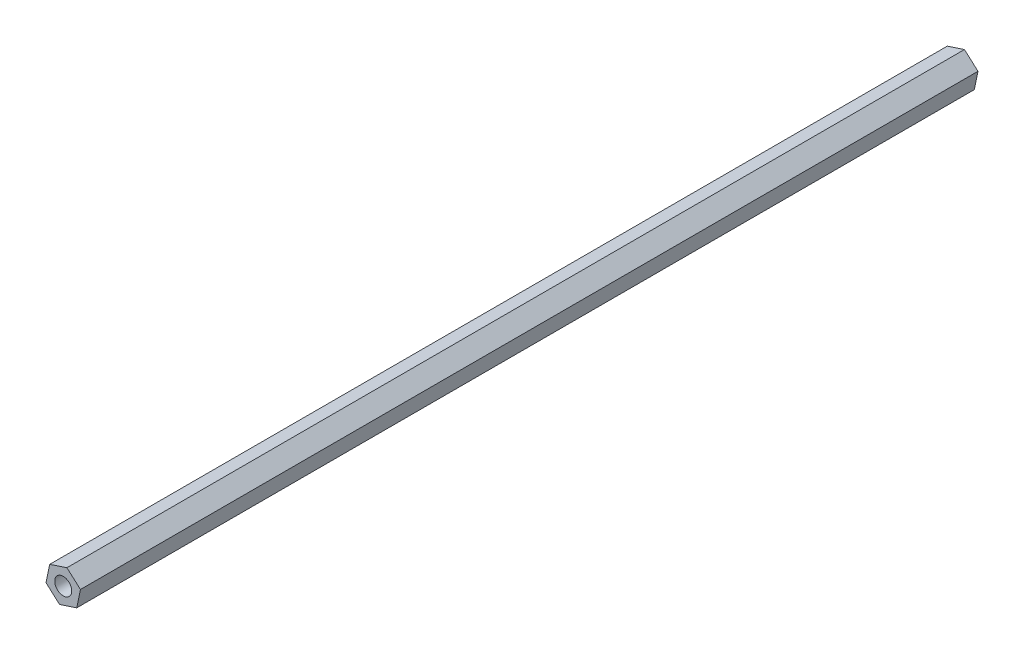
ISO-10303-21;
HEADER;
FILE_DESCRIPTION(('STEP AP214'),'2;1');
FILE_NAME('part.step','',(''),(''),'','','');
FILE_SCHEMA(('AUTOMOTIVE_DESIGN { 1 0 10303 214 1 1 1 1 }'));
ENDSEC;
DATA;
#1=APPLICATION_CONTEXT('core data for automotive mechanical design processes');
#2=APPLICATION_PROTOCOL_DEFINITION('international standard','automotive_design',2000,#1);
#3=PRODUCT_CONTEXT('',#1,'mechanical');
#4=PRODUCT('Part','Part','',(#3));
#5=PRODUCT_RELATED_PRODUCT_CATEGORY('part','',(#4));
#6=PRODUCT_DEFINITION_FORMATION('','',#4);
#7=PRODUCT_DEFINITION_CONTEXT('part definition',#1,'design');
#8=PRODUCT_DEFINITION('design','',#6,#7);
#9=PRODUCT_DEFINITION_SHAPE('','',#8);
#10=(LENGTH_UNIT() NAMED_UNIT(*) SI_UNIT(.MILLI.,.METRE.));
#11=(NAMED_UNIT(*) PLANE_ANGLE_UNIT() SI_UNIT($,.RADIAN.));
#12=(NAMED_UNIT(*) SI_UNIT($,.STERADIAN.) SOLID_ANGLE_UNIT());
#13=UNCERTAINTY_MEASURE_WITH_UNIT(LENGTH_MEASURE(1.E-05),#10,'distance_accuracy_value','');
#14=(GEOMETRIC_REPRESENTATION_CONTEXT(3) GLOBAL_UNCERTAINTY_ASSIGNED_CONTEXT((#13)) GLOBAL_UNIT_ASSIGNED_CONTEXT((#10,
#11,#12)) REPRESENTATION_CONTEXT('',''));
#15=CARTESIAN_POINT('',(0.,0.,0.));
#16=DIRECTION('',(0.,0.,1.));
#17=DIRECTION('',(1.,0.,0.));
#18=AXIS2_PLACEMENT_3D('',#15,#16,#17);
#19=CARTESIAN_POINT('',(2.71432127636962,-2.42125174417019,180.));
#20=DIRECTION('',(-0.979102767295746,0.203366101093109,0.));
#21=DIRECTION('',(-0.203366101093109,-0.979102767295746,0.));
#22=AXIS2_PLACEMENT_3D('',#19,#20,#21);
#23=PLANE('',#22);
#24=DIRECTION('',(0.203366101093109,0.979102767295746,0.));
#25=VECTOR('',#24,1.);
#26=CARTESIAN_POINT('',(2.71432127636962,-2.42125174417019,0.));
#27=LINE('',#26,#25);
#28=CARTESIAN_POINT('',(2.71432127636962,-2.42125174417019,0.));
#29=VERTEX_POINT('',#28);
#30=CARTESIAN_POINT('',(3.45402615759358,1.1400453072836,0.));
#31=VERTEX_POINT('',#30);
#32=EDGE_CURVE('E117',#29,#31,#27,.T.);
#33=ORIENTED_EDGE('',*,*,#32,.T.);
#34=DIRECTION('',(0.,0.,-1.));
#35=VECTOR('',#34,1.);
#36=CARTESIAN_POINT('',(3.45402615759358,1.1400453072836,180.));
#37=LINE('',#36,#35);
#38=CARTESIAN_POINT('',(3.45402615759358,1.1400453072836,180.));
#39=VERTEX_POINT('',#38);
#40=EDGE_CURVE('E11',#39,#31,#37,.T.);
#41=ORIENTED_EDGE('',*,*,#40,.F.);
#42=DIRECTION('',(0.203366101093109,0.979102767295746,0.));
#43=VECTOR('',#42,1.);
#44=CARTESIAN_POINT('',(2.71432127636962,-2.42125174417019,180.));
#45=LINE('',#44,#43);
#46=CARTESIAN_POINT('',(2.71432127636962,-2.42125174417019,180.));
#47=VERTEX_POINT('',#46);
#48=EDGE_CURVE('E128',#47,#39,#45,.T.);
#49=ORIENTED_EDGE('',*,*,#48,.F.);
#50=DIRECTION('',(0.,0.,-1.));
#51=VECTOR('',#50,1.);
#52=CARTESIAN_POINT('',(2.71432127636962,-2.42125174417019,180.));
#53=LINE('',#52,#51);
#54=EDGE_CURVE('E113',#47,#29,#53,.T.);
#55=ORIENTED_EDGE('',*,*,#54,.T.);
#56=EDGE_LOOP('',(#33,#41,#49,#55));
#57=FACE_BOUND('',#56,.T.);
#58=ADVANCED_FACE('F33',(#57),#23,.F.);
#59=CARTESIAN_POINT('',(3.45402615759358,1.1400453072836,180.));
#60=DIRECTION('',(-0.6656715934631,-0.746244818847205,0.));
#61=DIRECTION('',(0.746244818847205,-0.6656715934631,0.));
#62=AXIS2_PLACEMENT_3D('',#59,#60,#61);
#63=PLANE('',#62);
#64=DIRECTION('',(-0.746244818847205,0.6656715934631,0.));
#65=VECTOR('',#64,1.);
#66=CARTESIAN_POINT('',(3.45402615759358,1.1400453072836,0.));
#67=LINE('',#66,#65);
#68=CARTESIAN_POINT('',(0.739704881223952,3.56129705145379,0.));
#69=VERTEX_POINT('',#68);
#70=EDGE_CURVE('E120',#31,#69,#67,.T.);
#71=ORIENTED_EDGE('',*,*,#70,.T.);
#72=DIRECTION('',(0.,0.,-1.));
#73=VECTOR('',#72,1.);
#74=CARTESIAN_POINT('',(0.739704881223952,3.56129705145379,180.));
#75=LINE('',#74,#73);
#76=CARTESIAN_POINT('',(0.739704881223952,3.56129705145379,180.));
#77=VERTEX_POINT('',#76);
#78=EDGE_CURVE('E41',#77,#69,#75,.T.);
#79=ORIENTED_EDGE('',*,*,#78,.F.);
#80=DIRECTION('',(-0.746244818847205,0.6656715934631,0.));
#81=VECTOR('',#80,1.);
#82=CARTESIAN_POINT('',(3.45402615759358,1.1400453072836,180.));
#83=LINE('',#82,#81);
#84=EDGE_CURVE('E86',#39,#77,#83,.T.);
#85=ORIENTED_EDGE('',*,*,#84,.F.);
#86=ORIENTED_EDGE('',*,*,#40,.T.);
#87=EDGE_LOOP('',(#71,#79,#85,#86));
#88=FACE_BOUND('',#87,.T.);
#89=ADVANCED_FACE('F153',(#88),#63,.F.);
#90=CARTESIAN_POINT('',(0.739704881223952,3.56129705145379,180.));
#91=DIRECTION('',(0.313431173832646,-0.949610919940314,0.));
#92=DIRECTION('',(0.949610919940314,0.313431173832646,0.));
#93=AXIS2_PLACEMENT_3D('',#90,#91,#92);
#94=PLANE('',#93);
#95=DIRECTION('',(-0.949610919940314,-0.313431173832646,0.));
#96=VECTOR('',#95,1.);
#97=CARTESIAN_POINT('',(0.739704881223952,3.56129705145379,0.));
#98=LINE('',#97,#96);
#99=CARTESIAN_POINT('',(-2.71432127636962,2.42125174417019,0.));
#100=VERTEX_POINT('',#99);
#101=EDGE_CURVE('E123',#69,#100,#98,.T.);
#102=ORIENTED_EDGE('',*,*,#101,.T.);
#103=DIRECTION('',(0.,0.,-1.));
#104=VECTOR('',#103,1.);
#105=CARTESIAN_POINT('',(-2.71432127636962,2.42125174417019,180.));
#106=LINE('',#105,#104);
#107=CARTESIAN_POINT('',(-2.71432127636962,2.42125174417019,180.));
#108=VERTEX_POINT('',#107);
#109=EDGE_CURVE('E108',#108,#100,#106,.T.);
#110=ORIENTED_EDGE('',*,*,#109,.F.);
#111=DIRECTION('',(-0.949610919940314,-0.313431173832646,0.));
#112=VECTOR('',#111,1.);
#113=CARTESIAN_POINT('',(0.739704881223952,3.56129705145379,180.));
#114=LINE('',#113,#112);
#115=EDGE_CURVE('E99',#77,#108,#114,.T.);
#116=ORIENTED_EDGE('',*,*,#115,.F.);
#117=ORIENTED_EDGE('',*,*,#78,.T.);
#118=EDGE_LOOP('',(#102,#110,#116,#117));
#119=FACE_BOUND('',#118,.T.);
#120=ADVANCED_FACE('F134',(#119),#94,.F.);
#121=CARTESIAN_POINT('',(-2.71432127636962,2.42125174417019,180.));
#122=DIRECTION('',(0.979102767295746,-0.203366101093109,0.));
#123=DIRECTION('',(0.203366101093109,0.979102767295746,0.));
#124=AXIS2_PLACEMENT_3D('',#121,#122,#123);
#125=PLANE('',#124);
#126=DIRECTION('',(-0.203366101093109,-0.979102767295746,0.));
#127=VECTOR('',#126,1.);
#128=CARTESIAN_POINT('',(-2.71432127636962,2.42125174417019,0.));
#129=LINE('',#128,#127);
#130=CARTESIAN_POINT('',(-3.45402615759358,-1.1400453072836,0.));
#131=VERTEX_POINT('',#130);
#132=EDGE_CURVE('E107',#100,#131,#129,.T.);
#133=ORIENTED_EDGE('',*,*,#132,.T.);
#134=DIRECTION('',(0.,0.,-1.));
#135=VECTOR('',#134,1.);
#136=CARTESIAN_POINT('',(-3.45402615759358,-1.1400453072836,180.));
#137=LINE('',#136,#135);
#138=CARTESIAN_POINT('',(-3.45402615759358,-1.1400453072836,180.));
#139=VERTEX_POINT('',#138);
#140=EDGE_CURVE('E104',#139,#131,#137,.T.);
#141=ORIENTED_EDGE('',*,*,#140,.F.);
#142=DIRECTION('',(-0.203366101093109,-0.979102767295746,0.));
#143=VECTOR('',#142,1.);
#144=CARTESIAN_POINT('',(-2.71432127636962,2.42125174417019,180.));
#145=LINE('',#144,#143);
#146=EDGE_CURVE('E93',#108,#139,#145,.T.);
#147=ORIENTED_EDGE('',*,*,#146,.F.);
#148=ORIENTED_EDGE('',*,*,#109,.T.);
#149=EDGE_LOOP('',(#133,#141,#147,#148));
#150=FACE_BOUND('',#149,.T.);
#151=ADVANCED_FACE('F105',(#150),#125,.F.);
#152=CARTESIAN_POINT('',(-3.45402615759358,-1.1400453072836,180.));
#153=DIRECTION('',(0.6656715934631,0.746244818847205,0.));
#154=DIRECTION('',(-0.746244818847205,0.6656715934631,0.));
#155=AXIS2_PLACEMENT_3D('',#152,#153,#154);
#156=PLANE('',#155);
#157=DIRECTION('',(0.746244818847205,-0.6656715934631,0.));
#158=VECTOR('',#157,1.);
#159=CARTESIAN_POINT('',(-3.45402615759358,-1.1400453072836,0.));
#160=LINE('',#159,#158);
#161=CARTESIAN_POINT('',(-0.739704881223952,-3.56129705145379,0.));
#162=VERTEX_POINT('',#161);
#163=EDGE_CURVE('E72',#131,#162,#160,.T.);
#164=ORIENTED_EDGE('',*,*,#163,.T.);
#165=DIRECTION('',(0.,0.,-1.));
#166=VECTOR('',#165,1.);
#167=CARTESIAN_POINT('',(-0.739704881223952,-3.56129705145379,180.));
#168=LINE('',#167,#166);
#169=CARTESIAN_POINT('',(-0.739704881223952,-3.56129705145379,180.));
#170=VERTEX_POINT('',#169);
#171=EDGE_CURVE('E109',#170,#162,#168,.T.);
#172=ORIENTED_EDGE('',*,*,#171,.F.);
#173=DIRECTION('',(0.746244818847205,-0.6656715934631,0.));
#174=VECTOR('',#173,1.);
#175=CARTESIAN_POINT('',(-3.45402615759358,-1.1400453072836,180.));
#176=LINE('',#175,#174);
#177=EDGE_CURVE('E97',#139,#170,#176,.T.);
#178=ORIENTED_EDGE('',*,*,#177,.F.);
#179=ORIENTED_EDGE('',*,*,#140,.T.);
#180=EDGE_LOOP('',(#164,#172,#178,#179));
#181=FACE_BOUND('',#180,.T.);
#182=ADVANCED_FACE('F111',(#181),#156,.F.);
#183=CARTESIAN_POINT('',(-0.739704881223952,-3.56129705145379,180.));
#184=DIRECTION('',(-0.313431173832646,0.949610919940314,0.));
#185=DIRECTION('',(-0.949610919940314,-0.313431173832646,0.));
#186=AXIS2_PLACEMENT_3D('',#183,#184,#185);
#187=PLANE('',#186);
#188=DIRECTION('',(0.949610919940314,0.313431173832646,0.));
#189=VECTOR('',#188,1.);
#190=CARTESIAN_POINT('',(-0.739704881223952,-3.56129705145379,0.));
#191=LINE('',#190,#189);
#192=EDGE_CURVE('E78',#162,#29,#191,.T.);
#193=ORIENTED_EDGE('',*,*,#192,.T.);
#194=ORIENTED_EDGE('',*,*,#54,.F.);
#195=DIRECTION('',(0.949610919940314,0.313431173832646,0.));
#196=VECTOR('',#195,1.);
#197=CARTESIAN_POINT('',(-0.739704881223952,-3.56129705145379,180.));
#198=LINE('',#197,#196);
#199=EDGE_CURVE('E49',#170,#47,#198,.T.);
#200=ORIENTED_EDGE('',*,*,#199,.F.);
#201=ORIENTED_EDGE('',*,*,#171,.T.);
#202=EDGE_LOOP('',(#193,#194,#200,#201));
#203=FACE_BOUND('',#202,.T.);
#204=ADVANCED_FACE('F141',(#203),#187,.F.);
#205=CARTESIAN_POINT('',(0.,0.,180.));
#206=DIRECTION('',(0.,0.,1.));
#207=DIRECTION('',(1.,0.,0.));
#208=AXIS2_PLACEMENT_3D('',#205,#206,#207);
#209=PLANE('',#208);
#210=CARTESIAN_POINT('',(0.,0.,180.));
#211=DIRECTION('',(0.,0.,1.));
#212=DIRECTION('',(1.,0.,0.));
#213=AXIS2_PLACEMENT_3D('',#210,#211,#212);
#214=CIRCLE('',#213,1.7);
#215=CARTESIAN_POINT('',(1.7,0.,180.));
#216=VERTEX_POINT('',#215);
#217=EDGE_CURVE('E208',#216,#216,#214,.T.);
#218=ORIENTED_EDGE('',*,*,#217,.F.);
#219=EDGE_LOOP('',(#218));
#220=FACE_BOUND('',#219,.T.);
#221=ORIENTED_EDGE('',*,*,#48,.T.);
#222=ORIENTED_EDGE('',*,*,#84,.T.);
#223=ORIENTED_EDGE('',*,*,#115,.T.);
#224=ORIENTED_EDGE('',*,*,#146,.T.);
#225=ORIENTED_EDGE('',*,*,#177,.T.);
#226=ORIENTED_EDGE('',*,*,#199,.T.);
#227=EDGE_LOOP('',(#221,#222,#223,#224,#225,#226));
#228=FACE_BOUND('',#227,.T.);
#229=ADVANCED_FACE('F95',(#220,#228),#209,.T.);
#230=CARTESIAN_POINT('',(0.,0.,0.));
#231=DIRECTION('',(0.,0.,1.));
#232=DIRECTION('',(1.,0.,0.));
#233=AXIS2_PLACEMENT_3D('',#230,#231,#232);
#234=PLANE('',#233);
#235=CARTESIAN_POINT('',(0.,0.,0.));
#236=DIRECTION('',(0.,0.,1.));
#237=DIRECTION('',(1.,0.,0.));
#238=AXIS2_PLACEMENT_3D('',#235,#236,#237);
#239=CIRCLE('',#238,1.7);
#240=CARTESIAN_POINT('',(1.7,0.,0.));
#241=VERTEX_POINT('',#240);
#242=EDGE_CURVE('E121',#241,#241,#239,.T.);
#243=ORIENTED_EDGE('',*,*,#242,.T.);
#244=EDGE_LOOP('',(#243));
#245=FACE_BOUND('',#244,.T.);
#246=ORIENTED_EDGE('',*,*,#32,.F.);
#247=ORIENTED_EDGE('',*,*,#192,.F.);
#248=ORIENTED_EDGE('',*,*,#163,.F.);
#249=ORIENTED_EDGE('',*,*,#132,.F.);
#250=ORIENTED_EDGE('',*,*,#101,.F.);
#251=ORIENTED_EDGE('',*,*,#70,.F.);
#252=EDGE_LOOP('',(#246,#247,#248,#249,#250,#251));
#253=FACE_BOUND('',#252,.T.);
#254=ADVANCED_FACE('F137',(#245,#253),#234,.F.);
#255=CARTESIAN_POINT('',(0.,0.,0.));
#256=DIRECTION('',(0.,0.,1.));
#257=DIRECTION('',(1.,0.,0.));
#258=AXIS2_PLACEMENT_3D('',#255,#256,#257);
#259=CYLINDRICAL_SURFACE('',#258,1.7);
#260=ORIENTED_EDGE('',*,*,#242,.F.);
#261=EDGE_LOOP('',(#260));
#262=FACE_BOUND('',#261,.T.);
#263=ORIENTED_EDGE('',*,*,#217,.T.);
#264=EDGE_LOOP('',(#263));
#265=FACE_BOUND('',#264,.T.);
#266=ADVANCED_FACE('F190',(#262,#265),#259,.F.);
#267=CLOSED_SHELL('',(#58,#89,#120,#151,#182,#204,#229,#254,#266));
#268=MANIFOLD_SOLID_BREP('B2',#267);
#269=ADVANCED_BREP_SHAPE_REPRESENTATION('',(#18,#268),#14);
#270=SHAPE_DEFINITION_REPRESENTATION(#9,#269);
ENDSEC;
END-ISO-10303-21;
